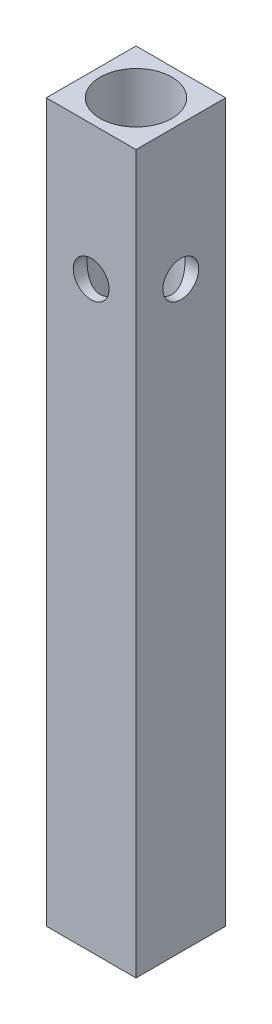
ISO-10303-21;
HEADER;
FILE_DESCRIPTION(('STEP AP214'),'2;1');
FILE_NAME('part.step','',(''),(''),'','','');
FILE_SCHEMA(('AUTOMOTIVE_DESIGN { 1 0 10303 214 1 1 1 1 }'));
ENDSEC;
DATA;
#1=APPLICATION_CONTEXT('core data for automotive mechanical design processes');
#2=APPLICATION_PROTOCOL_DEFINITION('international standard','automotive_design',2000,#1);
#3=PRODUCT_CONTEXT('',#1,'mechanical');
#4=PRODUCT('Part','Part','',(#3));
#5=PRODUCT_RELATED_PRODUCT_CATEGORY('part','',(#4));
#6=PRODUCT_DEFINITION_FORMATION('','',#4);
#7=PRODUCT_DEFINITION_CONTEXT('part definition',#1,'design');
#8=PRODUCT_DEFINITION('design','',#6,#7);
#9=PRODUCT_DEFINITION_SHAPE('','',#8);
#10=(LENGTH_UNIT() NAMED_UNIT(*) SI_UNIT(.MILLI.,.METRE.));
#11=(NAMED_UNIT(*) PLANE_ANGLE_UNIT() SI_UNIT($,.RADIAN.));
#12=(NAMED_UNIT(*) SI_UNIT($,.STERADIAN.) SOLID_ANGLE_UNIT());
#13=UNCERTAINTY_MEASURE_WITH_UNIT(LENGTH_MEASURE(1.E-05),#10,'distance_accuracy_value','');
#14=(GEOMETRIC_REPRESENTATION_CONTEXT(3) GLOBAL_UNCERTAINTY_ASSIGNED_CONTEXT((#13)) GLOBAL_UNIT_ASSIGNED_CONTEXT((#10,
#11,#12)) REPRESENTATION_CONTEXT('',''));
#15=CARTESIAN_POINT('',(0.,0.,0.));
#16=DIRECTION('',(0.,0.,1.));
#17=DIRECTION('',(1.,0.,0.));
#18=AXIS2_PLACEMENT_3D('',#15,#16,#17);
#19=CARTESIAN_POINT('',(-5.,80.,-5.));
#20=DIRECTION('',(1.,0.,0.));
#21=DIRECTION('',(0.,0.,-1.));
#22=AXIS2_PLACEMENT_3D('',#19,#20,#21);
#23=PLANE('',#22);
#24=CARTESIAN_POINT('',(-5.,65.,0.));
#25=DIRECTION('',(1.,0.,0.));
#26=DIRECTION('',(0.,0.,-1.));
#27=AXIS2_PLACEMENT_3D('',#24,#25,#26);
#28=CIRCLE('',#27,2.);
#29=CARTESIAN_POINT('',(-5.,65.,-2.));
#30=VERTEX_POINT('',#29);
#31=EDGE_CURVE('E124',#30,#30,#28,.T.);
#32=ORIENTED_EDGE('',*,*,#31,.T.);
#33=EDGE_LOOP('',(#32));
#34=FACE_BOUND('',#33,.T.);
#35=DIRECTION('',(0.,0.,1.));
#36=VECTOR('',#35,1.);
#37=CARTESIAN_POINT('',(-5.,0.,-5.));
#38=LINE('',#37,#36);
#39=CARTESIAN_POINT('',(-5.,0.,-5.));
#40=VERTEX_POINT('',#39);
#41=CARTESIAN_POINT('',(-5.,0.,5.));
#42=VERTEX_POINT('',#41);
#43=EDGE_CURVE('E107',#40,#42,#38,.T.);
#44=ORIENTED_EDGE('',*,*,#43,.T.);
#45=DIRECTION('',(0.,-1.,0.));
#46=VECTOR('',#45,1.);
#47=CARTESIAN_POINT('',(-5.,80.,5.));
#48=LINE('',#47,#46);
#49=CARTESIAN_POINT('',(-5.,80.,5.));
#50=VERTEX_POINT('',#49);
#51=EDGE_CURVE('E11',#50,#42,#48,.T.);
#52=ORIENTED_EDGE('',*,*,#51,.F.);
#53=DIRECTION('',(0.,0.,1.));
#54=VECTOR('',#53,1.);
#55=CARTESIAN_POINT('',(-5.,80.,-5.));
#56=LINE('',#55,#54);
#57=CARTESIAN_POINT('',(-5.,80.,-5.));
#58=VERTEX_POINT('',#57);
#59=EDGE_CURVE('E94',#58,#50,#56,.T.);
#60=ORIENTED_EDGE('',*,*,#59,.F.);
#61=DIRECTION('',(0.,-1.,0.));
#62=VECTOR('',#61,1.);
#63=CARTESIAN_POINT('',(-5.,80.,-5.));
#64=LINE('',#63,#62);
#65=EDGE_CURVE('E103',#58,#40,#64,.T.);
#66=ORIENTED_EDGE('',*,*,#65,.T.);
#67=EDGE_LOOP('',(#44,#52,#60,#66));
#68=FACE_BOUND('',#67,.T.);
#69=ADVANCED_FACE('F36',(#34,#68),#23,.F.);
#70=CARTESIAN_POINT('',(-5.,80.,5.));
#71=DIRECTION('',(0.,0.,-1.));
#72=DIRECTION('',(-1.,0.,0.));
#73=AXIS2_PLACEMENT_3D('',#70,#71,#72);
#74=PLANE('',#73);
#75=CARTESIAN_POINT('',(0.,65.,5.));
#76=DIRECTION('',(0.,0.,-1.));
#77=DIRECTION('',(-1.,0.,0.));
#78=AXIS2_PLACEMENT_3D('',#75,#76,#77);
#79=CIRCLE('',#78,2.);
#80=CARTESIAN_POINT('',(-2.,65.,5.));
#81=VERTEX_POINT('',#80);
#82=EDGE_CURVE('E204',#81,#81,#79,.T.);
#83=ORIENTED_EDGE('',*,*,#82,.T.);
#84=EDGE_LOOP('',(#83));
#85=FACE_BOUND('',#84,.T.);
#86=DIRECTION('',(1.,0.,0.));
#87=VECTOR('',#86,1.);
#88=CARTESIAN_POINT('',(-5.,0.,5.));
#89=LINE('',#88,#87);
#90=CARTESIAN_POINT('',(5.,0.,5.));
#91=VERTEX_POINT('',#90);
#92=EDGE_CURVE('E98',#42,#91,#89,.T.);
#93=ORIENTED_EDGE('',*,*,#92,.T.);
#94=DIRECTION('',(0.,-1.,0.));
#95=VECTOR('',#94,1.);
#96=CARTESIAN_POINT('',(5.,80.,5.));
#97=LINE('',#96,#95);
#98=CARTESIAN_POINT('',(5.,80.,5.));
#99=VERTEX_POINT('',#98);
#100=EDGE_CURVE('E50',#99,#91,#97,.T.);
#101=ORIENTED_EDGE('',*,*,#100,.F.);
#102=DIRECTION('',(1.,0.,0.));
#103=VECTOR('',#102,1.);
#104=CARTESIAN_POINT('',(-5.,80.,5.));
#105=LINE('',#104,#103);
#106=EDGE_CURVE('E89',#50,#99,#105,.T.);
#107=ORIENTED_EDGE('',*,*,#106,.F.);
#108=ORIENTED_EDGE('',*,*,#51,.T.);
#109=EDGE_LOOP('',(#93,#101,#107,#108));
#110=FACE_BOUND('',#109,.T.);
#111=ADVANCED_FACE('F97',(#85,#110),#74,.F.);
#112=CARTESIAN_POINT('',(5.,80.,-5.));
#113=DIRECTION('',(-1.,0.,0.));
#114=DIRECTION('',(0.,0.,1.));
#115=AXIS2_PLACEMENT_3D('',#112,#113,#114);
#116=PLANE('',#115);
#117=CARTESIAN_POINT('',(5.,65.,0.));
#118=DIRECTION('',(1.,0.,0.));
#119=DIRECTION('',(0.,0.,-1.));
#120=AXIS2_PLACEMENT_3D('',#117,#118,#119);
#121=CIRCLE('',#120,2.);
#122=CARTESIAN_POINT('',(5.,65.,-2.));
#123=VERTEX_POINT('',#122);
#124=EDGE_CURVE('E180',#123,#123,#121,.T.);
#125=ORIENTED_EDGE('',*,*,#124,.F.);
#126=EDGE_LOOP('',(#125));
#127=FACE_BOUND('',#126,.T.);
#128=DIRECTION('',(0.,0.,-1.));
#129=VECTOR('',#128,1.);
#130=CARTESIAN_POINT('',(5.,0.,-5.));
#131=LINE('',#130,#129);
#132=CARTESIAN_POINT('',(5.,0.,-5.));
#133=VERTEX_POINT('',#132);
#134=EDGE_CURVE('E76',#91,#133,#131,.T.);
#135=ORIENTED_EDGE('',*,*,#134,.T.);
#136=DIRECTION('',(0.,-1.,0.));
#137=VECTOR('',#136,1.);
#138=CARTESIAN_POINT('',(5.,80.,-5.));
#139=LINE('',#138,#137);
#140=CARTESIAN_POINT('',(5.,80.,-5.));
#141=VERTEX_POINT('',#140);
#142=EDGE_CURVE('E99',#141,#133,#139,.T.);
#143=ORIENTED_EDGE('',*,*,#142,.F.);
#144=DIRECTION('',(0.,0.,-1.));
#145=VECTOR('',#144,1.);
#146=CARTESIAN_POINT('',(5.,80.,-5.));
#147=LINE('',#146,#145);
#148=EDGE_CURVE('E92',#99,#141,#147,.T.);
#149=ORIENTED_EDGE('',*,*,#148,.F.);
#150=ORIENTED_EDGE('',*,*,#100,.T.);
#151=EDGE_LOOP('',(#135,#143,#149,#150));
#152=FACE_BOUND('',#151,.T.);
#153=ADVANCED_FACE('F101',(#127,#152),#116,.F.);
#154=CARTESIAN_POINT('',(-5.,80.,-5.));
#155=DIRECTION('',(0.,0.,1.));
#156=DIRECTION('',(1.,0.,0.));
#157=AXIS2_PLACEMENT_3D('',#154,#155,#156);
#158=PLANE('',#157);
#159=CARTESIAN_POINT('',(0.,65.,-5.));
#160=DIRECTION('',(0.,0.,-1.));
#161=DIRECTION('',(-1.,0.,0.));
#162=AXIS2_PLACEMENT_3D('',#159,#160,#161);
#163=CIRCLE('',#162,2.);
#164=CARTESIAN_POINT('',(-2.,65.,-5.));
#165=VERTEX_POINT('',#164);
#166=EDGE_CURVE('E201',#165,#165,#163,.T.);
#167=ORIENTED_EDGE('',*,*,#166,.F.);
#168=EDGE_LOOP('',(#167));
#169=FACE_BOUND('',#168,.T.);
#170=DIRECTION('',(-1.,0.,0.));
#171=VECTOR('',#170,1.);
#172=CARTESIAN_POINT('',(-5.,0.,-5.));
#173=LINE('',#172,#171);
#174=EDGE_CURVE('E82',#133,#40,#173,.T.);
#175=ORIENTED_EDGE('',*,*,#174,.T.);
#176=ORIENTED_EDGE('',*,*,#65,.F.);
#177=DIRECTION('',(-1.,0.,0.));
#178=VECTOR('',#177,1.);
#179=CARTESIAN_POINT('',(-5.,80.,-5.));
#180=LINE('',#179,#178);
#181=EDGE_CURVE('E59',#141,#58,#180,.T.);
#182=ORIENTED_EDGE('',*,*,#181,.F.);
#183=ORIENTED_EDGE('',*,*,#142,.T.);
#184=EDGE_LOOP('',(#175,#176,#182,#183));
#185=FACE_BOUND('',#184,.T.);
#186=ADVANCED_FACE('F168',(#169,#185),#158,.F.);
#187=CARTESIAN_POINT('',(0.,80.,0.));
#188=DIRECTION('',(0.,1.,0.));
#189=DIRECTION('',(0.,0.,1.));
#190=AXIS2_PLACEMENT_3D('',#187,#188,#189);
#191=PLANE('',#190);
#192=CARTESIAN_POINT('',(0.,80.,0.));
#193=DIRECTION('',(0.,1.,0.));
#194=DIRECTION('',(0.,0.,1.));
#195=AXIS2_PLACEMENT_3D('',#192,#193,#194);
#196=CIRCLE('',#195,4.);
#197=CARTESIAN_POINT('',(0.,80.,4.));
#198=VERTEX_POINT('',#197);
#199=EDGE_CURVE('E188',#198,#198,#196,.T.);
#200=ORIENTED_EDGE('',*,*,#199,.F.);
#201=EDGE_LOOP('',(#200));
#202=FACE_BOUND('',#201,.T.);
#203=ORIENTED_EDGE('',*,*,#59,.T.);
#204=ORIENTED_EDGE('',*,*,#106,.T.);
#205=ORIENTED_EDGE('',*,*,#148,.T.);
#206=ORIENTED_EDGE('',*,*,#181,.T.);
#207=EDGE_LOOP('',(#203,#204,#205,#206));
#208=FACE_BOUND('',#207,.T.);
#209=ADVANCED_FACE('F90',(#202,#208),#191,.T.);
#210=CARTESIAN_POINT('',(0.,0.,0.));
#211=DIRECTION('',(0.,1.,0.));
#212=DIRECTION('',(0.,0.,1.));
#213=AXIS2_PLACEMENT_3D('',#210,#211,#212);
#214=PLANE('',#213);
#215=ORIENTED_EDGE('',*,*,#43,.F.);
#216=ORIENTED_EDGE('',*,*,#174,.F.);
#217=ORIENTED_EDGE('',*,*,#134,.F.);
#218=ORIENTED_EDGE('',*,*,#92,.F.);
#219=EDGE_LOOP('',(#215,#216,#217,#218));
#220=FACE_BOUND('',#219,.T.);
#221=ADVANCED_FACE('F149',(#220),#214,.F.);
#222=CARTESIAN_POINT('',(0.,5.,0.));
#223=DIRECTION('',(0.,1.,0.));
#224=DIRECTION('',(0.,0.,1.));
#225=AXIS2_PLACEMENT_3D('',#222,#223,#224);
#226=CYLINDRICAL_SURFACE('',#225,4.);
#227=CARTESIAN_POINT('',(0.,63.,4.));
#228=CARTESIAN_POINT('',(0.105143925902467,63.0000066046344,3.99999426810082));
#229=CARTESIAN_POINT('',(0.210413199395125,63.0083401462421,3.99580982039513));
#230=CARTESIAN_POINT('',(0.417840470537792,63.0413057606831,3.97948312074314));
#231=CARTESIAN_POINT('',(0.519992173427258,63.0659687859956,3.96732575657839));
#232=CARTESIAN_POINT('',(0.717867089760897,63.1303876172333,3.93632558806751));
#233=CARTESIAN_POINT('',(0.813613605878293,63.1700847684959,3.91750878355075));
#234=CARTESIAN_POINT('',(0.996945233613196,63.26314124273,3.87491553031523));
#235=CARTESIAN_POINT('',(1.08453098798011,63.3164994884977,3.85113947267051));
#236=CARTESIAN_POINT('',(1.25501563552381,63.4390344989706,3.79912516516124));
#237=CARTESIAN_POINT('',(1.33731042224422,63.5089729584793,3.77070398255074));
#238=CARTESIAN_POINT('',(1.48955888973396,63.6610429584941,3.71319940493486));
#239=CARTESIAN_POINT('',(1.55950316621354,63.7431837035449,3.68411552418069));
#240=CARTESIAN_POINT('',(1.69050400090056,63.9249666990468,3.62597902394695));
#241=CARTESIAN_POINT('',(1.75045067110327,64.0254721966918,3.59710373940264));
#242=CARTESIAN_POINT('',(1.85233645378139,64.2367346719724,3.54571957544641));
#243=CARTESIAN_POINT('',(1.89428842993267,64.3474842574455,3.52320615213979));
#244=CARTESIAN_POINT('',(1.95626488437717,64.5693302108438,3.48915734075617));
#245=CARTESIAN_POINT('',(1.97745171416088,64.6800089041348,3.47704543167427));
#246=CARTESIAN_POINT('',(2.00085398661769,64.9039576755589,3.46363779897055));
#247=CARTESIAN_POINT('',(2.00308817674615,65.0172250817423,3.46233138686576));
#248=CARTESIAN_POINT('',(1.98937457434459,65.2285720486307,3.47021860514497));
#249=CARTESIAN_POINT('',(1.97556911907364,65.3268480624461,3.47817527324027));
#250=CARTESIAN_POINT('',(1.93387969811386,65.5194438187461,3.501524574677));
#251=CARTESIAN_POINT('',(1.9059912477953,65.6137622906106,3.51691957663553));
#252=CARTESIAN_POINT('',(1.836419560772,65.7984582651313,3.55374952825482));
#253=CARTESIAN_POINT('',(1.79443013423199,65.8886927975716,3.57531681327997));
#254=CARTESIAN_POINT('',(1.698083375336,66.06126858518,3.62206808562807));
#255=CARTESIAN_POINT('',(1.64372048762493,66.1436062712002,3.64725369560381));
#256=CARTESIAN_POINT('',(1.51613210982558,66.3090425054865,3.70226315806572));
#257=CARTESIAN_POINT('',(1.44138891673856,66.3909137471523,3.73227020473492));
#258=CARTESIAN_POINT('',(1.27911115748275,66.5414708371818,3.79095246600814));
#259=CARTESIAN_POINT('',(1.19157051314857,66.6101503840678,3.81962703917602));
#260=CARTESIAN_POINT('',(1.0010330116637,66.7353713220594,3.87403974565928));
#261=CARTESIAN_POINT('',(0.89750718319882,66.7912009448915,3.89957968324014));
#262=CARTESIAN_POINT('',(0.6809324309776,66.884194058086,3.94315762242484));
#263=CARTESIAN_POINT('',(0.567891152530562,66.9213723700303,3.96120157887106));
#264=CARTESIAN_POINT('',(0.345532983321417,66.9729508074334,3.98648667482871));
#265=CARTESIAN_POINT('',(0.236683061096664,66.9889824714936,3.9944987660262));
#266=CARTESIAN_POINT('',(0.0175591998987126,67.002929462269,4.00146026918207));
#267=CARTESIAN_POINT('',(-0.0927140397398086,67.0008533712789,4.00041397442637));
#268=CARTESIAN_POINT('',(-0.302465943971967,66.9795866231625,3.9898238450687));
#269=CARTESIAN_POINT('',(-0.402118816099854,66.96173493454,3.98094491376337));
#270=CARTESIAN_POINT('',(-0.596813784603877,66.9115238562098,3.9564434262968));
#271=CARTESIAN_POINT('',(-0.691855371382169,66.879162867093,3.94082012668824));
#272=CARTESIAN_POINT('',(-0.877777216899139,66.8000030671339,3.90368502827176));
#273=CARTESIAN_POINT('',(-0.968460794011599,66.7528178997674,3.88201763539262));
#274=CARTESIAN_POINT('',(-1.14092272339854,66.6457849287069,3.83487948634835));
#275=CARTESIAN_POINT('',(-1.22269725955318,66.5859317308092,3.80940711133877));
#276=CARTESIAN_POINT('',(-1.38353537857843,66.4484791493386,3.75416442672396));
#277=CARTESIAN_POINT('',(-1.46154415563805,66.3697142631097,3.72421769686999));
#278=CARTESIAN_POINT('',(-1.60371264223771,66.2001496974445,3.6652478321764));
#279=CARTESIAN_POINT('',(-1.66786277142374,66.1093417623042,3.63622534800094));
#280=CARTESIAN_POINT('',(-1.78341582895803,65.9127126916541,3.58102384412979));
#281=CARTESIAN_POINT('',(-1.8340509916005,65.806377467811,3.55505059178121));
#282=CARTESIAN_POINT('',(-1.91616565186941,65.5849798648501,3.51148144588269));
#283=CARTESIAN_POINT('',(-1.94766983173403,65.4699289470662,3.493874764435));
#284=CARTESIAN_POINT('',(-1.98772337493375,65.2461795542306,3.47123002051604));
#285=CARTESIAN_POINT('',(-1.9981859928109,65.1379314931295,3.4651476693013));
#286=CARTESIAN_POINT('',(-2.00137830875241,64.921105865671,3.46330709283206));
#287=CARTESIAN_POINT('',(-1.99411569324649,64.8125284625243,3.4675443925278));
#288=CARTESIAN_POINT('',(-1.96385225118662,64.6090329969331,3.48475724102153));
#289=CARTESIAN_POINT('',(-1.94241662868607,64.5137990597105,3.49686188965317));
#290=CARTESIAN_POINT('',(-1.88635071644883,64.3283837611513,3.52742032375305));
#291=CARTESIAN_POINT('',(-1.85171618231985,64.238204035816,3.54587615139336));
#292=CARTESIAN_POINT('',(-1.76763149060114,64.0587502980269,3.58857060729071));
#293=CARTESIAN_POINT('',(-1.71734227563141,63.969944196342,3.61311444791841));
#294=CARTESIAN_POINT('',(-1.60430194327479,63.8014509276375,3.6647066326972));
#295=CARTESIAN_POINT('',(-1.54154434248313,63.7217685389578,3.69175627591221));
#296=CARTESIAN_POINT('',(-1.39640665332275,63.5637160352907,3.74924646316184));
#297=CARTESIAN_POINT('',(-1.31256884599452,63.4866817952994,3.77969966613256));
#298=CARTESIAN_POINT('',(-1.1323096124664,63.3474740331295,3.83755504519861));
#299=CARTESIAN_POINT('',(-1.0358814466104,63.2853085210602,3.8649555725239));
#300=CARTESIAN_POINT('',(-0.831863193565897,63.1775272745759,3.91396019133074));
#301=CARTESIAN_POINT('',(-0.724199007553467,63.1320316615271,3.93552192987866));
#302=CARTESIAN_POINT('',(-0.50148420227618,63.0603836644852,3.97002682597974));
#303=CARTESIAN_POINT('',(-0.386455599178208,63.0341763063886,3.98299446726135));
#304=CARTESIAN_POINT('',(-0.225203892981797,63.0122051778285,3.99390923826956));
#305=CARTESIAN_POINT('',(-0.180323758883135,63.0076347182673,3.99618730680502));
#306=CARTESIAN_POINT('',(-0.0903034636101859,63.0015306689718,3.99923393953631));
#307=CARTESIAN_POINT('',(-0.0451632952932583,62.9999971630596,4.00000246206762));
#308=CARTESIAN_POINT('',(0.,63.,4.));
#309=B_SPLINE_CURVE_WITH_KNOTS('',3,(#227,#228,#229,#230,#231,#232,#233,#234,#235,#236,#237,
#238,#239,#240,#241,#242,#243,#244,#245,#246,#247,#248,#249,#250,#251,#252,#253,#254,#255,#256,
#257,#258,#259,#260,#261,#262,#263,#264,#265,#266,#267,#268,#269,#270,#271,#272,#273,#274,#275,
#276,#277,#278,#279,#280,#281,#282,#283,#284,#285,#286,#287,#288,#289,#290,#291,#292,#293,#294,
#295,#296,#297,#298,#299,#300,#301,#302,#303,#304,#305,#306,#307,#308),.UNSPECIFIED.,.T.,.F.,(4,
2,2,2,2,2,2,2,2,2,2,2,2,2,2,2,2,2,2,2,2,2,2,2,2,2,2,2,2,2,2,2,2,2,2,2,2,2,2,2,4),(0.,
0.315248514840584,0.631096299418395,0.945724310984596,1.26032752116313,1.59396351743618,
1.92785247530807,2.28763452861505,2.64715895796562,2.98516024280458,3.32282714658039,
3.62011424818642,3.91749607851357,4.22180480336976,4.52625042520444,4.86929882667757,
5.21251069197373,5.57166044428881,5.93052433824558,6.2596658094269,6.58865129022951,
6.89213813012243,7.19565843261863,7.50785712055796,7.82018901496678,8.16319221288838,
8.50643177230863,8.86629364323451,9.22569023890902,9.55058615006094,9.87534119729355,
10.1691586049771,10.463070575767,10.7767291356057,11.0905512228726,11.4425048551434,
11.7946476676249,12.1492802732705,12.502898172423,12.6383056026783,12.7737167702213),.UNSPECIFIED.);
#310=CARTESIAN_POINT('',(0.,63.,4.));
#311=VERTEX_POINT('',#310);
#312=EDGE_CURVE('E39',#311,#311,#309,.T.);
#313=ORIENTED_EDGE('',*,*,#312,.T.);
#314=EDGE_LOOP('',(#313));
#315=FACE_BOUND('',#314,.T.);
#316=CARTESIAN_POINT('',(-2.,65.,-3.46410161513775));
#317=CARTESIAN_POINT('',(-1.99999158748781,65.1042132054744,-3.46411185715887));
#318=CARTESIAN_POINT('',(-1.99179963610437,65.2085621765338,-3.46887633544978));
#319=CARTESIAN_POINT('',(-1.95944672580053,65.4140551772306,-3.48724701669072));
#320=CARTESIAN_POINT('',(-1.93525221095662,65.5151920032478,-3.50087179788183));
#321=CARTESIAN_POINT('',(-1.8721998159803,65.7109031564469,-3.53498701490001));
#322=CARTESIAN_POINT('',(-1.83341988295963,65.8055092588493,-3.55544089069169));
#323=CARTESIAN_POINT('',(-1.74253507245138,65.9868484504762,-3.60085327291133));
#324=CARTESIAN_POINT('',(-1.69042947410139,66.0735811134368,-3.62581202301253));
#325=CARTESIAN_POINT('',(-1.569333074538,66.2446114431334,-3.67993738819289));
#326=CARTESIAN_POINT('',(-1.49930407053533,66.3281182675918,-3.70928127465103));
#327=CARTESIAN_POINT('',(-1.34650761698202,66.4828167805706,-3.76743965382121));
#328=CARTESIAN_POINT('',(-1.26373385204842,66.554002326204,-3.79625387610258));
#329=CARTESIAN_POINT('',(-1.08097912631265,66.6867343011885,-3.85242953961661));
#330=CARTESIAN_POINT('',(-0.980214377887152,66.7473075354233,-3.87956212851245));
#331=CARTESIAN_POINT('',(-0.768314053336914,66.8502817067871,-3.92701512184167));
#332=CARTESIAN_POINT('',(-0.657185076311983,66.8926941123508,-3.94733982363631));
#333=CARTESIAN_POINT('',(-0.436089887818815,66.9550093225312,-3.97760922492053));
#334=CARTESIAN_POINT('',(-0.326603580968784,66.9762990526921,-3.98818960442739));
#335=CARTESIAN_POINT('',(-0.105141257404541,67.000332237369,-4.00015167691179));
#336=CARTESIAN_POINT('',(0.00683321168520583,67.0030869135963,-4.00153893568935));
#337=CARTESIAN_POINT('',(0.21966504884957,66.9905066520549,-3.99525963833124));
#338=CARTESIAN_POINT('',(0.320642398354136,66.9767239689564,-3.98836991784381));
#339=CARTESIAN_POINT('',(0.518627543836086,66.9342383121919,-3.96748490519435));
#340=CARTESIAN_POINT('',(0.615635042187699,66.9055342220479,-3.95348908132771));
#341=CARTESIAN_POINT('',(0.804618783139258,66.8338348678201,-3.91943166575325));
#342=CARTESIAN_POINT('',(0.896506847030398,66.7906473736558,-3.89928883058403));
#343=CARTESIAN_POINT('',(1.07195360302662,66.6914731675971,-3.8547529197337));
#344=CARTESIAN_POINT('',(1.15550929767728,66.6354818733953,-3.83035832314967));
#345=CARTESIAN_POINT('',(1.3203473217964,66.5062092969339,-3.7768878879846));
#346=CARTESIAN_POINT('',(1.40066815005873,66.431793943348,-3.7475875199635));
#347=CARTESIAN_POINT('',(1.54820874059556,66.2708205501397,-3.68908681173623));
#348=CARTESIAN_POINT('',(1.61541842314846,66.1842532554519,-3.65988656531258));
#349=CARTESIAN_POINT('',(1.73901066928442,65.9947036151518,-3.6028831218497));
#350=CARTESIAN_POINT('',(1.7944346299561,65.8910279538916,-3.57528639981415));
#351=CARTESIAN_POINT('',(1.88663822600246,65.674124657282,-3.52750900557152));
#352=CARTESIAN_POINT('',(1.92343731642178,65.5609071339649,-3.50732060092135));
#353=CARTESIAN_POINT('',(1.97436042205008,65.3375709774344,-3.47889271634069));
#354=CARTESIAN_POINT('',(1.99005024423995,65.2279177619129,-3.46983311696993));
#355=CARTESIAN_POINT('',(2.00303389322285,65.0071973169669,-3.46235838723219));
#356=CARTESIAN_POINT('',(2.00034071463005,64.8961311417604,-3.46393573778623));
#357=CARTESIAN_POINT('',(1.97807208668793,64.6886921628426,-3.4766867308117));
#358=CARTESIAN_POINT('',(1.96037563342492,64.5920410977842,-3.48679175013308));
#359=CARTESIAN_POINT('',(1.91139256926488,64.403264427458,-3.51388043102683));
#360=CARTESIAN_POINT('',(1.88010155724726,64.3111402985065,-3.53086632010068));
#361=CARTESIAN_POINT('',(1.80329517720973,64.1291773381949,-3.57072444159313));
#362=CARTESIAN_POINT('',(1.75718812738529,64.0396419662939,-3.59383286486126));
#363=CARTESIAN_POINT('',(1.65257412803175,63.869061456921,-3.643122389945));
#364=CARTESIAN_POINT('',(1.59406080866498,63.7880207129695,-3.66930506710298));
#365=CARTESIAN_POINT('',(1.45767433439708,63.6260424649573,-3.72575996912669));
#366=CARTESIAN_POINT('',(1.37829054462747,63.5464056985822,-3.75613166308566));
#367=CARTESIAN_POINT('',(1.20680899079903,63.4011755239953,-3.81468469955797));
#368=CARTESIAN_POINT('',(1.1147069493199,63.3355868594732,-3.84286530015464));
#369=CARTESIAN_POINT('',(0.917070725108052,63.2188525481673,-3.89482723381868));
#370=CARTESIAN_POINT('',(0.811246195112489,63.1681337638332,-3.91847283343884));
#371=CARTESIAN_POINT('',(0.591044729317861,63.0857241920304,-3.95766709918776));
#372=CARTESIAN_POINT('',(0.476675402917649,63.0540166963159,-3.97322287353397));
#373=CARTESIAN_POINT('',(0.253959364539762,63.0132628725149,-3.99335016363174));
#374=CARTESIAN_POINT('',(0.1460228872683,63.0024042513357,-3.9987985581427));
#375=CARTESIAN_POINT('',(-0.0702519714699442,62.9983134660043,-4.00084260752374));
#376=CARTESIAN_POINT('',(-0.178590198981613,63.0050751314711,-3.99744136141634));
#377=CARTESIAN_POINT('',(-0.385075986136855,63.0348328243164,-3.98267937668509));
#378=CARTESIAN_POINT('',(-0.483424641057412,63.0567297373091,-3.97185789309443));
#379=CARTESIAN_POINT('',(-0.674891898931559,63.1146539598067,-3.94384187353387));
#380=CARTESIAN_POINT('',(-0.768009749669768,63.1506832957069,-3.92664642364424));
#381=CARTESIAN_POINT('',(-0.950846833596739,63.2374542549914,-3.88651861393181));
#382=CARTESIAN_POINT('',(-1.0402503657229,63.2887592197519,-3.86337234005404));
#383=CARTESIAN_POINT('',(-1.20954920326828,63.4039152881181,-3.81376266676027));
#384=CARTESIAN_POINT('',(-1.28944011444319,63.4677721541016,-3.78729774583428));
#385=CARTESIAN_POINT('',(-1.44582833859495,63.6135966355594,-3.73057218840582));
#386=CARTESIAN_POINT('',(-1.52119665879199,63.6967341808003,-3.70019591726075));
#387=CARTESIAN_POINT('',(-1.65732528394005,63.8748922283061,-3.64126158628571));
#388=CARTESIAN_POINT('',(-1.71807266521244,63.9699231313605,-3.61270515130784));
#389=CARTESIAN_POINT('',(-1.82486714716811,64.1733088941302,-3.55999186256751));
#390=CARTESIAN_POINT('',(-1.87038902381914,64.2819899107353,-3.53600256268535));
#391=CARTESIAN_POINT('',(-1.92395929504801,64.4505781196309,-3.5069621813237));
#392=CARTESIAN_POINT('',(-1.93935666147967,64.5076478205907,-3.49844389329401));
#393=CARTESIAN_POINT('',(-1.96508069805043,64.6232325575002,-3.48406059323535));
#394=CARTESIAN_POINT('',(-1.97541091343283,64.6817465527542,-3.47819372636051));
#395=CARTESIAN_POINT('',(-1.9887293296122,64.7836007892473,-3.47059023668758));
#396=CARTESIAN_POINT('',(-1.99295091983786,64.8267330572501,-3.46816389731816));
#397=CARTESIAN_POINT('',(-1.99858810035606,64.9132356930929,-3.46491740045177));
#398=CARTESIAN_POINT('',(-2.00000350293331,64.9566060766667,-3.46409735040492));
#399=CARTESIAN_POINT('',(-2.,65.,-3.46410161513775));
#400=B_SPLINE_CURVE_WITH_KNOTS('',3,(#316,#317,#318,#319,#320,#321,#322,#323,#324,#325,#326,
#327,#328,#329,#330,#331,#332,#333,#334,#335,#336,#337,#338,#339,#340,#341,#342,#343,#344,#345,
#346,#347,#348,#349,#350,#351,#352,#353,#354,#355,#356,#357,#358,#359,#360,#361,#362,#363,#364,
#365,#366,#367,#368,#369,#370,#371,#372,#373,#374,#375,#376,#377,#378,#379,#380,#381,#382,#383,
#384,#385,#386,#387,#388,#389,#390,#391,#392,#393,#394,#395,#396,#397,#398,#399),.UNSPECIFIED.,
.T.,.F.,(4,2,2,2,2,2,2,2,2,2,2,2,2,2,2,2,2,2,2,2,2,2,2,2,2,2,2,2,2,2,2,2,2,2,2,2,2,2,2,2,2,4),
(0.,0.312464245189433,0.62558578564961,0.937057191861541,1.24854545093096,1.58572462503713,
1.92307142172809,2.28315784481594,2.64301653931849,2.97726969939937,3.31132047376146,
3.61632194973143,3.92134625038977,4.2305906946636,4.53994598704611,4.87854382917849,
5.21740096495904,5.57777683462963,5.93777548427476,6.26924581712488,6.60048186380811,
6.89548366852121,7.19058104876194,7.49934592816243,7.80826972444162,8.15613487165295,
8.50411729960472,8.86128362829999,9.2181355962161,9.5422454078304,9.8662417359201,
10.1688884974705,10.4715786702809,10.7872150144301,11.102996602055,11.450204837042,
11.7977188569437,12.1562149808128,12.3351395323571,12.5139387197526,12.6440387634035,
12.7741475095882),.UNSPECIFIED.);
#401=CARTESIAN_POINT('',(-2.,65.,-3.46410161513775));
#402=VERTEX_POINT('',#401);
#403=EDGE_CURVE('E184',#402,#402,#400,.T.);
#404=ORIENTED_EDGE('',*,*,#403,.T.);
#405=EDGE_LOOP('',(#404));
#406=FACE_BOUND('',#405,.T.);
#407=CARTESIAN_POINT('',(-3.46410161513776,65.,-2.));
#408=CARTESIAN_POINT('',(-3.46411185715888,64.8957867945256,-1.99999158748781));
#409=CARTESIAN_POINT('',(-3.46887633544978,64.7914378234662,-1.99179963610437));
#410=CARTESIAN_POINT('',(-3.48724701669072,64.5859448227694,-1.95944672580053));
#411=CARTESIAN_POINT('',(-3.50087179788183,64.4848079967522,-1.93525221095662));
#412=CARTESIAN_POINT('',(-3.53498701490002,64.2890968435531,-1.8721998159803));
#413=CARTESIAN_POINT('',(-3.55544089069169,64.1944907411507,-1.83341988295963));
#414=CARTESIAN_POINT('',(-3.60085327291133,64.0131515495238,-1.74253507245138));
#415=CARTESIAN_POINT('',(-3.62581202301253,63.9264188865632,-1.69042947410139));
#416=CARTESIAN_POINT('',(-3.67993738819289,63.7553885568666,-1.569333074538));
#417=CARTESIAN_POINT('',(-3.70928127465103,63.6718817324082,-1.49930407053533));
#418=CARTESIAN_POINT('',(-3.76743965382121,63.5171832194294,-1.34650761698202));
#419=CARTESIAN_POINT('',(-3.79625387610258,63.445997673796,-1.26373385204841));
#420=CARTESIAN_POINT('',(-3.85242953961661,63.3132656988115,-1.08097912631265));
#421=CARTESIAN_POINT('',(-3.87956212851245,63.2526924645767,-0.980214377887151));
#422=CARTESIAN_POINT('',(-3.92701512184167,63.1497182932129,-0.768314053336913));
#423=CARTESIAN_POINT('',(-3.94733982363631,63.1073058876492,-0.657185076311981));
#424=CARTESIAN_POINT('',(-3.97760922492053,63.0449906774688,-0.436089887818814));
#425=CARTESIAN_POINT('',(-3.9881896044274,63.0237009473079,-0.326603580968783));
#426=CARTESIAN_POINT('',(-4.00015167691179,62.999667762631,-0.105141257404539));
#427=CARTESIAN_POINT('',(-4.00153893568935,62.9969130864037,0.00683321168520797));
#428=CARTESIAN_POINT('',(-3.99525963833124,63.0094933479451,0.219665048849572));
#429=CARTESIAN_POINT('',(-3.98836991784381,63.0232760310436,0.320642398354139));
#430=CARTESIAN_POINT('',(-3.96748490519435,63.0657616878081,0.518627543836089));
#431=CARTESIAN_POINT('',(-3.95348908132771,63.0944657779521,0.615635042187702));
#432=CARTESIAN_POINT('',(-3.91943166575325,63.1661651321799,0.804618783139261));
#433=CARTESIAN_POINT('',(-3.89928883058403,63.2093526263442,0.8965068470304));
#434=CARTESIAN_POINT('',(-3.8547529197337,63.3085268324029,1.07195360302662));
#435=CARTESIAN_POINT('',(-3.83035832314967,63.3645181266047,1.15550929767728));
#436=CARTESIAN_POINT('',(-3.7768878879846,63.4937907030661,1.32034732179641));
#437=CARTESIAN_POINT('',(-3.7475875199635,63.568206056652,1.40066815005873));
#438=CARTESIAN_POINT('',(-3.68908681173623,63.7291794498603,1.54820874059556));
#439=CARTESIAN_POINT('',(-3.65988656531257,63.8157467445481,1.61541842314846));
#440=CARTESIAN_POINT('',(-3.60288312184969,64.0052963848482,1.73901066928442));
#441=CARTESIAN_POINT('',(-3.57528639981415,64.1089720461084,1.7944346299561));
#442=CARTESIAN_POINT('',(-3.52750900557152,64.325875342718,1.88663822600247));
#443=CARTESIAN_POINT('',(-3.50732060092135,64.4390928660351,1.92343731642178));
#444=CARTESIAN_POINT('',(-3.47889271634069,64.6624290225656,1.97436042205008));
#445=CARTESIAN_POINT('',(-3.46983311696993,64.7720822380871,1.99005024423995));
#446=CARTESIAN_POINT('',(-3.46235838723219,64.9928026830331,2.00303389322286));
#447=CARTESIAN_POINT('',(-3.46393573778623,65.1038688582396,2.00034071463006));
#448=CARTESIAN_POINT('',(-3.47668673081169,65.3113078371574,1.97807208668793));
#449=CARTESIAN_POINT('',(-3.48679175013308,65.4079589022158,1.96037563342493));
#450=CARTESIAN_POINT('',(-3.51388043102682,65.596735572542,1.9113925692649));
#451=CARTESIAN_POINT('',(-3.53086632010068,65.6888597014935,1.88010155724727));
#452=CARTESIAN_POINT('',(-3.57072444159313,65.8708226618051,1.80329517720973));
#453=CARTESIAN_POINT('',(-3.59383286486126,65.9603580337061,1.7571881273853));
#454=CARTESIAN_POINT('',(-3.643122389945,66.1309385430791,1.65257412803176));
#455=CARTESIAN_POINT('',(-3.66930506710298,66.2119792870305,1.59406080866498));
#456=CARTESIAN_POINT('',(-3.72575996912669,66.3739575350427,1.45767433439708));
#457=CARTESIAN_POINT('',(-3.75613166308566,66.4535943014178,1.37829054462747));
#458=CARTESIAN_POINT('',(-3.81468469955797,66.5988244760048,1.20680899079903));
#459=CARTESIAN_POINT('',(-3.84286530015464,66.6644131405268,1.1147069493199));
#460=CARTESIAN_POINT('',(-3.89482723381868,66.7811474518327,0.917070725108055));
#461=CARTESIAN_POINT('',(-3.91847283343884,66.8318662361668,0.811246195112492));
#462=CARTESIAN_POINT('',(-3.95766709918776,66.9142758079696,0.591044729317864));
#463=CARTESIAN_POINT('',(-3.97322287353397,66.9459833036841,0.476675402917652));
#464=CARTESIAN_POINT('',(-3.99335016363174,66.9867371274851,0.253959364539765));
#465=CARTESIAN_POINT('',(-3.9987985581427,66.9975957486643,0.146022887268303));
#466=CARTESIAN_POINT('',(-4.00084260752374,67.0016865339957,-0.0702519714699413));
#467=CARTESIAN_POINT('',(-3.99744136141634,66.9949248685289,-0.17859019898161));
#468=CARTESIAN_POINT('',(-3.98267937668509,66.9651671756836,-0.385075986136852));
#469=CARTESIAN_POINT('',(-3.97185789309443,66.9432702626909,-0.48342464105741));
#470=CARTESIAN_POINT('',(-3.94384187353387,66.8853460401933,-0.674891898931556));
#471=CARTESIAN_POINT('',(-3.92664642364424,66.8493167042931,-0.768009749669766));
#472=CARTESIAN_POINT('',(-3.88651861393181,66.7625457450086,-0.950846833596737));
#473=CARTESIAN_POINT('',(-3.86337234005404,66.7112407802481,-1.04025036572289));
#474=CARTESIAN_POINT('',(-3.81376266676027,66.5960847118819,-1.20954920326828));
#475=CARTESIAN_POINT('',(-3.78729774583428,66.5322278458984,-1.28944011444318));
#476=CARTESIAN_POINT('',(-3.73057218840582,66.3864033644406,-1.44582833859495));
#477=CARTESIAN_POINT('',(-3.70019591726075,66.3032658191997,-1.52119665879198));
#478=CARTESIAN_POINT('',(-3.64126158628571,66.1251077716939,-1.65732528394005));
#479=CARTESIAN_POINT('',(-3.61270515130784,66.0300768686395,-1.71807266521243));
#480=CARTESIAN_POINT('',(-3.55999186256751,65.8266911058698,-1.82486714716811));
#481=CARTESIAN_POINT('',(-3.53600256268535,65.7180100892647,-1.87038902381913));
#482=CARTESIAN_POINT('',(-3.5069621813237,65.5494218803691,-1.923959295048));
#483=CARTESIAN_POINT('',(-3.49844389329401,65.4923521794093,-1.93935666147967));
#484=CARTESIAN_POINT('',(-3.48406059323535,65.3767674424998,-1.96508069805043));
#485=CARTESIAN_POINT('',(-3.47819372636051,65.3182534472458,-1.97541091343282));
#486=CARTESIAN_POINT('',(-3.47059023668758,65.2163992107527,-1.9887293296122));
#487=CARTESIAN_POINT('',(-3.46816389731816,65.1732669427499,-1.99295091983786));
#488=CARTESIAN_POINT('',(-3.46491740045177,65.0867643069071,-1.99858810035606));
#489=CARTESIAN_POINT('',(-3.46409735040492,65.0433939233333,-2.00000350293331));
#490=CARTESIAN_POINT('',(-3.46410161513776,65.,-2.));
#491=B_SPLINE_CURVE_WITH_KNOTS('',3,(#407,#408,#409,#410,#411,#412,#413,#414,#415,#416,#417,
#418,#419,#420,#421,#422,#423,#424,#425,#426,#427,#428,#429,#430,#431,#432,#433,#434,#435,#436,
#437,#438,#439,#440,#441,#442,#443,#444,#445,#446,#447,#448,#449,#450,#451,#452,#453,#454,#455,
#456,#457,#458,#459,#460,#461,#462,#463,#464,#465,#466,#467,#468,#469,#470,#471,#472,#473,#474,
#475,#476,#477,#478,#479,#480,#481,#482,#483,#484,#485,#486,#487,#488,#489,#490),.UNSPECIFIED.,
.T.,.F.,(4,2,2,2,2,2,2,2,2,2,2,2,2,2,2,2,2,2,2,2,2,2,2,2,2,2,2,2,2,2,2,2,2,2,2,2,2,2,2,2,2,4),
(0.,0.312464245189433,0.62558578564961,0.937057191861541,1.24854545093096,1.58572462503713,
1.92307142172809,2.28315784481594,2.64301653931849,2.97726969939937,3.31132047376146,
3.61632194973143,3.92134625038977,4.2305906946636,4.53994598704611,4.87854382917849,
5.21740096495904,5.57777683462963,5.93777548427476,6.26924581712488,6.60048186380811,
6.89548366852115,7.19058104876194,7.49934592816243,7.80826972444162,8.15613487165295,
8.50411729960472,8.86128362829999,9.2181355962161,9.5422454078304,9.8662417359201,
10.1688884974705,10.4715786702809,10.7872150144301,11.102996602055,11.450204837042,
11.7977188569437,12.1562149808128,12.3351395323571,12.5139387197526,12.6440387634035,
12.7741475095882),.UNSPECIFIED.);
#492=CARTESIAN_POINT('',(-3.46410161513776,65.,-2.));
#493=VERTEX_POINT('',#492);
#494=EDGE_CURVE('E123',#493,#493,#491,.T.);
#495=ORIENTED_EDGE('',*,*,#494,.T.);
#496=EDGE_LOOP('',(#495));
#497=FACE_BOUND('',#496,.T.);
#498=CARTESIAN_POINT('',(3.46410161513775,65.,-2.));
#499=CARTESIAN_POINT('',(3.46411185715888,65.1042132054744,-1.99999158748781));
#500=CARTESIAN_POINT('',(3.46887633544978,65.2085621765338,-1.99179963610437));
#501=CARTESIAN_POINT('',(3.48724701669072,65.4140551772306,-1.95944672580053));
#502=CARTESIAN_POINT('',(3.50087179788183,65.5151920032478,-1.93525221095662));
#503=CARTESIAN_POINT('',(3.53498701490001,65.7109031564469,-1.8721998159803));
#504=CARTESIAN_POINT('',(3.55544089069169,65.8055092588492,-1.83341988295964));
#505=CARTESIAN_POINT('',(3.60085327291132,65.9868484504761,-1.74253507245139));
#506=CARTESIAN_POINT('',(3.62581202301253,66.0735811134368,-1.69042947410139));
#507=CARTESIAN_POINT('',(3.67993738819289,66.2446114431334,-1.569333074538));
#508=CARTESIAN_POINT('',(3.70928127465103,66.3281182675918,-1.49930407053533));
#509=CARTESIAN_POINT('',(3.76743965382121,66.4828167805706,-1.34650761698202));
#510=CARTESIAN_POINT('',(3.79625387610258,66.554002326204,-1.26373385204841));
#511=CARTESIAN_POINT('',(3.85242953961661,66.6867343011885,-1.08097912631265));
#512=CARTESIAN_POINT('',(3.87956212851245,66.7473075354233,-0.980214377887152));
#513=CARTESIAN_POINT('',(3.92701512184167,66.8502817067871,-0.768314053336915));
#514=CARTESIAN_POINT('',(3.94733982363631,66.8926941123508,-0.657185076311983));
#515=CARTESIAN_POINT('',(3.97760922492053,66.9550093225312,-0.436089887818815));
#516=CARTESIAN_POINT('',(3.98818960442739,66.9762990526921,-0.326603580968785));
#517=CARTESIAN_POINT('',(4.00015167691179,67.000332237369,-0.105141257404542));
#518=CARTESIAN_POINT('',(4.00153893568935,67.0030869135963,0.00683321168520559));
#519=CARTESIAN_POINT('',(3.99525963833124,66.9905066520549,0.21966504884957));
#520=CARTESIAN_POINT('',(3.98836991784381,66.9767239689564,0.320642398354137));
#521=CARTESIAN_POINT('',(3.96748490519435,66.9342383121919,0.518627543836087));
#522=CARTESIAN_POINT('',(3.95348908132771,66.9055342220479,0.6156350421877));
#523=CARTESIAN_POINT('',(3.91943166575325,66.8338348678201,0.804618783139259));
#524=CARTESIAN_POINT('',(3.89928883058403,66.7906473736558,0.896506847030399));
#525=CARTESIAN_POINT('',(3.8547529197337,66.6914731675971,1.07195360302662));
#526=CARTESIAN_POINT('',(3.83035832314967,66.6354818733953,1.15550929767728));
#527=CARTESIAN_POINT('',(3.7768878879846,66.5062092969339,1.3203473217964));
#528=CARTESIAN_POINT('',(3.7475875199635,66.431793943348,1.40066815005873));
#529=CARTESIAN_POINT('',(3.68908681173623,66.2708205501397,1.54820874059556));
#530=CARTESIAN_POINT('',(3.65988656531257,66.1842532554519,1.61541842314846));
#531=CARTESIAN_POINT('',(3.60288312184969,65.9947036151518,1.73901066928442));
#532=CARTESIAN_POINT('',(3.57528639981415,65.8910279538916,1.7944346299561));
#533=CARTESIAN_POINT('',(3.52750900557152,65.674124657282,1.88663822600247));
#534=CARTESIAN_POINT('',(3.50732060092135,65.5609071339649,1.92343731642178));
#535=CARTESIAN_POINT('',(3.47889271634069,65.3375709774344,1.97436042205008));
#536=CARTESIAN_POINT('',(3.46983311696993,65.2279177619129,1.99005024423995));
#537=CARTESIAN_POINT('',(3.46235838723219,65.0071973169669,2.00303389322286));
#538=CARTESIAN_POINT('',(3.46393573778623,64.8961311417604,2.00034071463006));
#539=CARTESIAN_POINT('',(3.4766867308117,64.6886921628426,1.97807208668793));
#540=CARTESIAN_POINT('',(3.48679175013308,64.5920410977842,1.96037563342492));
#541=CARTESIAN_POINT('',(3.51388043102682,64.403264427458,1.91139256926489));
#542=CARTESIAN_POINT('',(3.53086632010068,64.3111402985065,1.88010155724727));
#543=CARTESIAN_POINT('',(3.57072444159313,64.1291773381949,1.80329517720973));
#544=CARTESIAN_POINT('',(3.59383286486126,64.0396419662939,1.7571881273853));
#545=CARTESIAN_POINT('',(3.643122389945,63.869061456921,1.65257412803175));
#546=CARTESIAN_POINT('',(3.66930506710298,63.7880207129695,1.59406080866498));
#547=CARTESIAN_POINT('',(3.72575996912669,63.6260424649573,1.45767433439708));
#548=CARTESIAN_POINT('',(3.75613166308566,63.5464056985822,1.37829054462747));
#549=CARTESIAN_POINT('',(3.81468469955797,63.4011755239953,1.20680899079903));
#550=CARTESIAN_POINT('',(3.84286530015464,63.3355868594732,1.1147069493199));
#551=CARTESIAN_POINT('',(3.89482723381868,63.2188525481673,0.917070725108054));
#552=CARTESIAN_POINT('',(3.91847283343884,63.1681337638332,0.811246195112491));
#553=CARTESIAN_POINT('',(3.95766709918776,63.0857241920304,0.591044729317864));
#554=CARTESIAN_POINT('',(3.97322287353397,63.0540166963159,0.476675402917653));
#555=CARTESIAN_POINT('',(3.99335016363174,63.0132628725149,0.253959364539767));
#556=CARTESIAN_POINT('',(3.9987985581427,63.0024042513357,0.146022887268304));
#557=CARTESIAN_POINT('',(4.00084260752374,62.9983134660043,-0.0702519714699395));
#558=CARTESIAN_POINT('',(3.99744136141634,63.0050751314711,-0.178590198981608));
#559=CARTESIAN_POINT('',(3.98267937668509,63.0348328243164,-0.38507598613685));
#560=CARTESIAN_POINT('',(3.97185789309443,63.0567297373091,-0.483424641057408));
#561=CARTESIAN_POINT('',(3.94384187353387,63.1146539598067,-0.674891898931555));
#562=CARTESIAN_POINT('',(3.92664642364424,63.1506832957069,-0.768009749669765));
#563=CARTESIAN_POINT('',(3.88651861393181,63.2374542549914,-0.950846833596731));
#564=CARTESIAN_POINT('',(3.86337234005404,63.2887592197518,-1.04025036572288));
#565=CARTESIAN_POINT('',(3.81376266676027,63.4039152881181,-1.20954920326827));
#566=CARTESIAN_POINT('',(3.78729774583428,63.4677721541016,-1.28944011444318));
#567=CARTESIAN_POINT('',(3.73057218840582,63.6135966355594,-1.44582833859495));
#568=CARTESIAN_POINT('',(3.70019591726075,63.6967341808003,-1.52119665879198));
#569=CARTESIAN_POINT('',(3.64126158628571,63.8748922283061,-1.65732528394005));
#570=CARTESIAN_POINT('',(3.61270515130784,63.9699231313605,-1.71807266521243));
#571=CARTESIAN_POINT('',(3.55999186256751,64.1733088941302,-1.82486714716811));
#572=CARTESIAN_POINT('',(3.53600256268535,64.2819899107353,-1.87038902381914));
#573=CARTESIAN_POINT('',(3.5069621813237,64.4505781196309,-1.92395929504801));
#574=CARTESIAN_POINT('',(3.49844389329401,64.5076478205907,-1.93935666147967));
#575=CARTESIAN_POINT('',(3.48406059323535,64.6232325575002,-1.96508069805043));
#576=CARTESIAN_POINT('',(3.47819372636051,64.6817465527542,-1.97541091343283));
#577=CARTESIAN_POINT('',(3.47059023668758,64.7836007892473,-1.9887293296122));
#578=CARTESIAN_POINT('',(3.46816389731816,64.8267330572501,-1.99295091983786));
#579=CARTESIAN_POINT('',(3.46491740045177,64.9132356930929,-1.99858810035606));
#580=CARTESIAN_POINT('',(3.46409735040492,64.9566060766667,-2.00000350293331));
#581=CARTESIAN_POINT('',(3.46410161513775,65.,-2.));
#582=B_SPLINE_CURVE_WITH_KNOTS('',3,(#498,#499,#500,#501,#502,#503,#504,#505,#506,#507,#508,
#509,#510,#511,#512,#513,#514,#515,#516,#517,#518,#519,#520,#521,#522,#523,#524,#525,#526,#527,
#528,#529,#530,#531,#532,#533,#534,#535,#536,#537,#538,#539,#540,#541,#542,#543,#544,#545,#546,
#547,#548,#549,#550,#551,#552,#553,#554,#555,#556,#557,#558,#559,#560,#561,#562,#563,#564,#565,
#566,#567,#568,#569,#570,#571,#572,#573,#574,#575,#576,#577,#578,#579,#580,#581),.UNSPECIFIED.,
.T.,.F.,(4,2,2,2,2,2,2,2,2,2,2,2,2,2,2,2,2,2,2,2,2,2,2,2,2,2,2,2,2,2,2,2,2,2,2,2,2,2,2,2,2,4),
(0.,0.312464245189433,0.62558578564961,0.937057191861525,1.24854545093096,1.58572462503713,
1.92307142172809,2.28315784481594,2.64301653931849,2.97726969939937,3.31132047376146,
3.61632194973143,3.92134625038977,4.2305906946636,4.53994598704611,4.87854382917849,
5.21740096495904,5.57777683462963,5.93777548427476,6.2692458171249,6.60048186380811,
6.89548366852119,7.19058104876193,7.49934592816243,7.80826972444162,8.15613487165295,
8.50411729960472,8.86128362829999,9.2181355962161,9.5422454078304,9.8662417359201,
10.1688884974705,10.4715786702809,10.7872150144301,11.102996602055,11.450204837042,
11.7977188569437,12.1562149808128,12.3351395323571,12.5139387197526,12.6440387634036,
12.7741475095882),.UNSPECIFIED.);
#583=CARTESIAN_POINT('',(3.46410161513775,65.,-2.));
#584=VERTEX_POINT('',#583);
#585=EDGE_CURVE('E116',#584,#584,#582,.T.);
#586=ORIENTED_EDGE('',*,*,#585,.T.);
#587=EDGE_LOOP('',(#586));
#588=FACE_BOUND('',#587,.T.);
#589=CARTESIAN_POINT('',(0.,5.,0.));
#590=DIRECTION('',(0.,1.,0.));
#591=DIRECTION('',(0.,0.,1.));
#592=AXIS2_PLACEMENT_3D('',#589,#590,#591);
#593=CIRCLE('',#592,4.);
#594=CARTESIAN_POINT('',(0.,5.,4.));
#595=VERTEX_POINT('',#594);
#596=EDGE_CURVE('E110',#595,#595,#593,.T.);
#597=ORIENTED_EDGE('',*,*,#596,.F.);
#598=EDGE_LOOP('',(#597));
#599=FACE_BOUND('',#598,.T.);
#600=ORIENTED_EDGE('',*,*,#199,.T.);
#601=EDGE_LOOP('',(#600));
#602=FACE_BOUND('',#601,.T.);
#603=ADVANCED_FACE('F128',(#315,#406,#497,#588,#599,#602),#226,.F.);
#604=CARTESIAN_POINT('',(0.,5.,0.));
#605=DIRECTION('',(0.,1.,0.));
#606=DIRECTION('',(0.,0.,1.));
#607=AXIS2_PLACEMENT_3D('',#604,#605,#606);
#608=PLANE('',#607);
#609=ORIENTED_EDGE('',*,*,#596,.T.);
#610=EDGE_LOOP('',(#609));
#611=FACE_BOUND('',#610,.T.);
#612=ADVANCED_FACE('F140',(#611),#608,.T.);
#613=CARTESIAN_POINT('',(-5.,65.,0.));
#614=DIRECTION('',(1.,0.,0.));
#615=DIRECTION('',(0.,0.,-1.));
#616=AXIS2_PLACEMENT_3D('',#613,#614,#615);
#617=CYLINDRICAL_SURFACE('',#616,2.);
#618=ORIENTED_EDGE('',*,*,#124,.T.);
#619=EDGE_LOOP('',(#618));
#620=FACE_BOUND('',#619,.T.);
#621=ORIENTED_EDGE('',*,*,#585,.F.);
#622=EDGE_LOOP('',(#621));
#623=FACE_BOUND('',#622,.T.);
#624=ADVANCED_FACE('F136',(#620,#623),#617,.F.);
#625=ORIENTED_EDGE('',*,*,#31,.F.);
#626=EDGE_LOOP('',(#625));
#627=FACE_BOUND('',#626,.T.);
#628=ORIENTED_EDGE('',*,*,#494,.F.);
#629=EDGE_LOOP('',(#628));
#630=FACE_BOUND('',#629,.T.);
#631=ADVANCED_FACE('F132',(#627,#630),#617,.F.);
#632=CARTESIAN_POINT('',(0.,65.,5.));
#633=DIRECTION('',(0.,0.,-1.));
#634=DIRECTION('',(-1.,0.,0.));
#635=AXIS2_PLACEMENT_3D('',#632,#633,#634);
#636=CYLINDRICAL_SURFACE('',#635,2.);
#637=ORIENTED_EDGE('',*,*,#166,.T.);
#638=EDGE_LOOP('',(#637));
#639=FACE_BOUND('',#638,.T.);
#640=ORIENTED_EDGE('',*,*,#403,.F.);
#641=EDGE_LOOP('',(#640));
#642=FACE_BOUND('',#641,.T.);
#643=ADVANCED_FACE('F135',(#639,#642),#636,.F.);
#644=ORIENTED_EDGE('',*,*,#82,.F.);
#645=EDGE_LOOP('',(#644));
#646=FACE_BOUND('',#645,.T.);
#647=ORIENTED_EDGE('',*,*,#312,.F.);
#648=EDGE_LOOP('',(#647));
#649=FACE_BOUND('',#648,.T.);
#650=ADVANCED_FACE('F138',(#646,#649),#636,.F.);
#651=CLOSED_SHELL('',(#69,#111,#153,#186,#209,#221,#603,#612,#624,#631,#643,#650));
#652=MANIFOLD_SOLID_BREP('B2',#651);
#653=ADVANCED_BREP_SHAPE_REPRESENTATION('',(#18,#652),#14);
#654=SHAPE_DEFINITION_REPRESENTATION(#9,#653);
ENDSEC;
END-ISO-10303-21;
